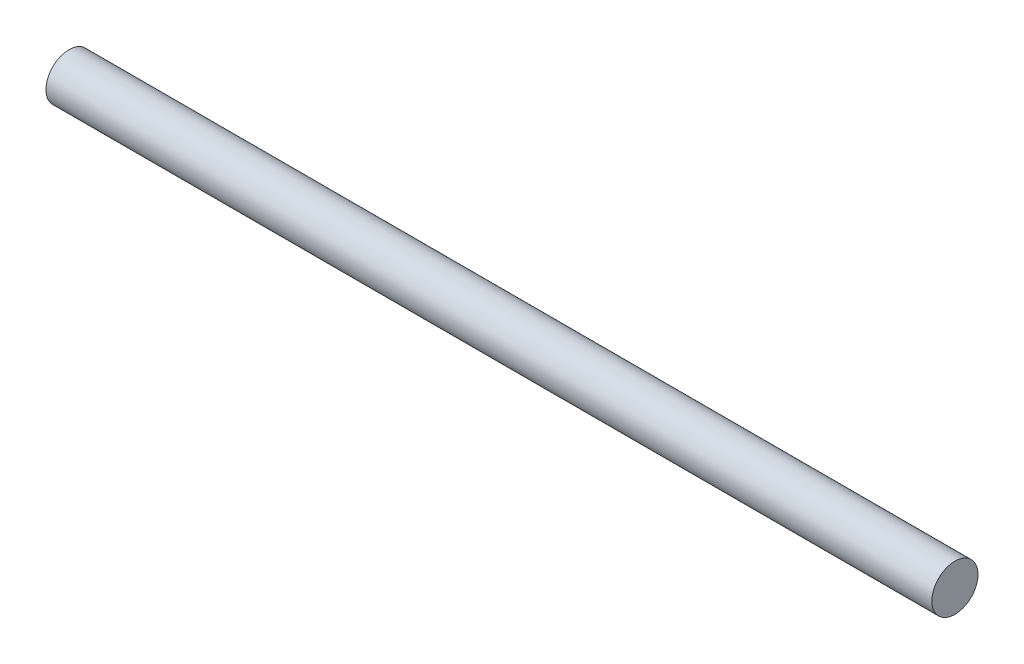
ISO-10303-21;
HEADER;
FILE_DESCRIPTION(('STEP AP214'),'2;1');
FILE_NAME('part.step','',(''),(''),'','','');
FILE_SCHEMA(('AUTOMOTIVE_DESIGN { 1 0 10303 214 1 1 1 1 }'));
ENDSEC;
DATA;
#1=APPLICATION_CONTEXT('core data for automotive mechanical design processes');
#2=APPLICATION_PROTOCOL_DEFINITION('international standard','automotive_design',2000,#1);
#3=PRODUCT_CONTEXT('',#1,'mechanical');
#4=PRODUCT('Part','Part','',(#3));
#5=PRODUCT_RELATED_PRODUCT_CATEGORY('part','',(#4));
#6=PRODUCT_DEFINITION_FORMATION('','',#4);
#7=PRODUCT_DEFINITION_CONTEXT('part definition',#1,'design');
#8=PRODUCT_DEFINITION('design','',#6,#7);
#9=PRODUCT_DEFINITION_SHAPE('','',#8);
#10=(LENGTH_UNIT() NAMED_UNIT(*) SI_UNIT(.MILLI.,.METRE.));
#11=(NAMED_UNIT(*) PLANE_ANGLE_UNIT() SI_UNIT($,.RADIAN.));
#12=(NAMED_UNIT(*) SI_UNIT($,.STERADIAN.) SOLID_ANGLE_UNIT());
#13=UNCERTAINTY_MEASURE_WITH_UNIT(LENGTH_MEASURE(1.E-05),#10,'distance_accuracy_value','');
#14=(GEOMETRIC_REPRESENTATION_CONTEXT(3) GLOBAL_UNCERTAINTY_ASSIGNED_CONTEXT((#13)) GLOBAL_UNIT_ASSIGNED_CONTEXT((#10,
#11,#12)) REPRESENTATION_CONTEXT('',''));
#15=CARTESIAN_POINT('',(0.,0.,0.));
#16=DIRECTION('',(0.,0.,1.));
#17=DIRECTION('',(1.,0.,0.));
#18=AXIS2_PLACEMENT_3D('',#15,#16,#17);
#19=CARTESIAN_POINT('',(96.,0.,0.));
#20=DIRECTION('',(-1.,0.,0.));
#21=DIRECTION('',(0.,0.,1.));
#22=AXIS2_PLACEMENT_3D('',#19,#20,#21);
#23=CYLINDRICAL_SURFACE('',#22,2.5);
#24=CARTESIAN_POINT('',(96.,0.,0.));
#25=DIRECTION('',(1.,0.,0.));
#26=DIRECTION('',(0.,0.,-1.));
#27=AXIS2_PLACEMENT_3D('',#24,#25,#26);
#28=CIRCLE('',#27,2.5);
#29=CARTESIAN_POINT('',(96.,0.,-2.5));
#30=VERTEX_POINT('',#29);
#31=EDGE_CURVE('E10',#30,#30,#28,.T.);
#32=ORIENTED_EDGE('',*,*,#31,.F.);
#33=EDGE_LOOP('',(#32));
#34=FACE_BOUND('',#33,.T.);
#35=CARTESIAN_POINT('',(0.,0.,0.));
#36=DIRECTION('',(1.,0.,0.));
#37=DIRECTION('',(0.,0.,-1.));
#38=AXIS2_PLACEMENT_3D('',#35,#36,#37);
#39=CIRCLE('',#38,2.5);
#40=CARTESIAN_POINT('',(0.,0.,-2.5));
#41=VERTEX_POINT('',#40);
#42=EDGE_CURVE('E33',#41,#41,#39,.T.);
#43=ORIENTED_EDGE('',*,*,#42,.T.);
#44=EDGE_LOOP('',(#43));
#45=FACE_BOUND('',#44,.T.);
#46=ADVANCED_FACE('F30',(#34,#45),#23,.T.);
#47=CARTESIAN_POINT('',(96.,0.,0.));
#48=DIRECTION('',(1.,0.,0.));
#49=DIRECTION('',(0.,0.,-1.));
#50=AXIS2_PLACEMENT_3D('',#47,#48,#49);
#51=PLANE('',#50);
#52=ORIENTED_EDGE('',*,*,#31,.T.);
#53=EDGE_LOOP('',(#52));
#54=FACE_BOUND('',#53,.T.);
#55=ADVANCED_FACE('F45',(#54),#51,.T.);
#56=CARTESIAN_POINT('',(0.,0.,0.));
#57=DIRECTION('',(1.,0.,0.));
#58=DIRECTION('',(0.,0.,-1.));
#59=AXIS2_PLACEMENT_3D('',#56,#57,#58);
#60=PLANE('',#59);
#61=ORIENTED_EDGE('',*,*,#42,.F.);
#62=EDGE_LOOP('',(#61));
#63=FACE_BOUND('',#62,.T.);
#64=ADVANCED_FACE('F43',(#63),#60,.F.);
#65=CLOSED_SHELL('',(#46,#55,#64));
#66=MANIFOLD_SOLID_BREP('B2',#65);
#67=ADVANCED_BREP_SHAPE_REPRESENTATION('',(#18,#66),#14);
#68=SHAPE_DEFINITION_REPRESENTATION(#9,#67);
ENDSEC;
END-ISO-10303-21;
